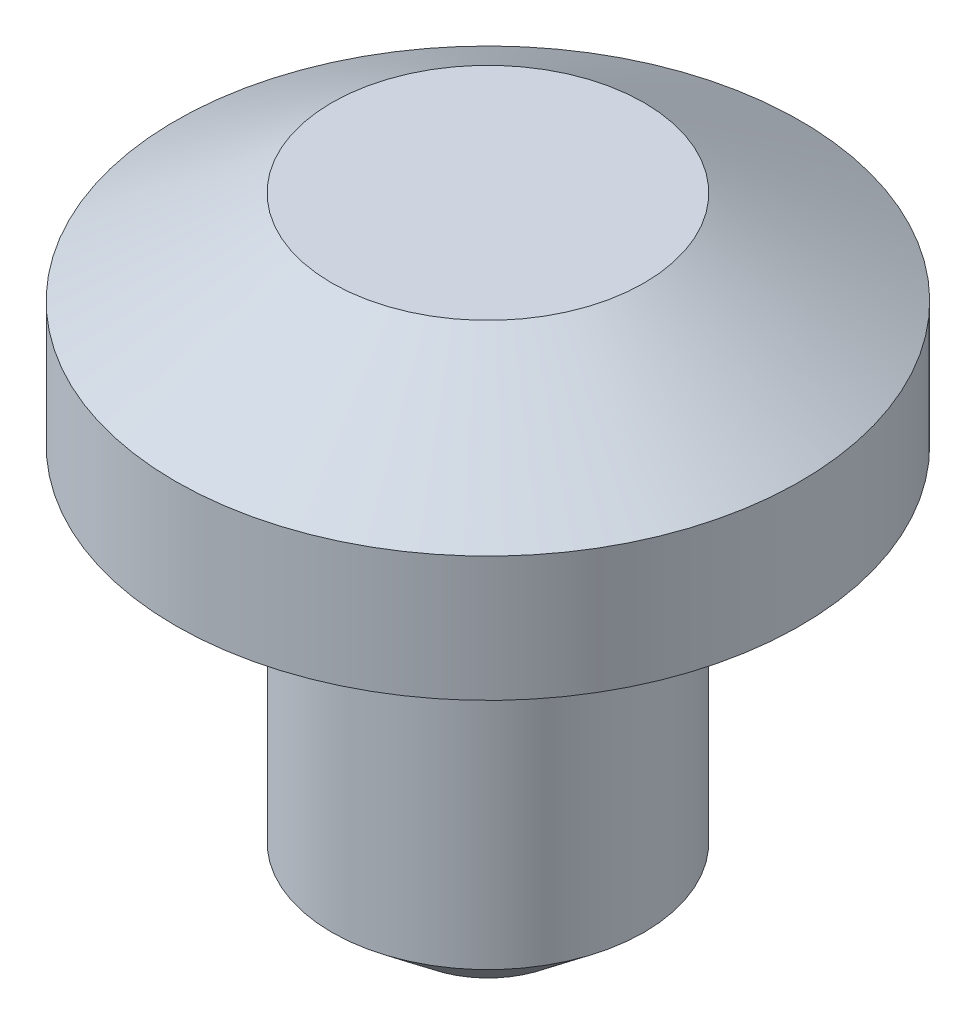
ISO-10303-21;
HEADER;
FILE_DESCRIPTION(('STEP AP214'),'2;1');
FILE_NAME('part.step','',(''),(''),'','','');
FILE_SCHEMA(('AUTOMOTIVE_DESIGN { 1 0 10303 214 1 1 1 1 }'));
ENDSEC;
DATA;
#1=APPLICATION_CONTEXT('core data for automotive mechanical design processes');
#2=APPLICATION_PROTOCOL_DEFINITION('international standard','automotive_design',2000,#1);
#3=PRODUCT_CONTEXT('',#1,'mechanical');
#4=PRODUCT('Part','Part','',(#3));
#5=PRODUCT_RELATED_PRODUCT_CATEGORY('part','',(#4));
#6=PRODUCT_DEFINITION_FORMATION('','',#4);
#7=PRODUCT_DEFINITION_CONTEXT('part definition',#1,'design');
#8=PRODUCT_DEFINITION('design','',#6,#7);
#9=PRODUCT_DEFINITION_SHAPE('','',#8);
#10=(LENGTH_UNIT() NAMED_UNIT(*) SI_UNIT(.MILLI.,.METRE.));
#11=(NAMED_UNIT(*) PLANE_ANGLE_UNIT() SI_UNIT($,.RADIAN.));
#12=(NAMED_UNIT(*) SI_UNIT($,.STERADIAN.) SOLID_ANGLE_UNIT());
#13=UNCERTAINTY_MEASURE_WITH_UNIT(LENGTH_MEASURE(1.E-05),#10,'distance_accuracy_value','');
#14=(GEOMETRIC_REPRESENTATION_CONTEXT(3) GLOBAL_UNCERTAINTY_ASSIGNED_CONTEXT((#13)) GLOBAL_UNIT_ASSIGNED_CONTEXT((#10,
#11,#12)) REPRESENTATION_CONTEXT('',''));
#15=CARTESIAN_POINT('',(0.,0.,0.));
#16=DIRECTION('',(0.,0.,1.));
#17=DIRECTION('',(1.,0.,0.));
#18=AXIS2_PLACEMENT_3D('',#15,#16,#17);
#19=CARTESIAN_POINT('',(0.,63.5,0.));
#20=DIRECTION('',(0.,1.,0.));
#21=DIRECTION('',(-1.,0.,0.));
#22=AXIS2_PLACEMENT_3D('',#19,#20,#21);
#23=CYLINDRICAL_SURFACE('',#22,31.75);
#24=CARTESIAN_POINT('',(0.,0.,0.));
#25=DIRECTION('',(0.,1.,0.));
#26=DIRECTION('',(0.,0.,1.));
#27=AXIS2_PLACEMENT_3D('',#24,#25,#26);
#28=CIRCLE('',#27,31.75);
#29=CARTESIAN_POINT('',(0.,0.,31.75));
#30=VERTEX_POINT('',#29);
#31=EDGE_CURVE('E46',#30,#30,#28,.T.);
#32=ORIENTED_EDGE('',*,*,#31,.F.);
#33=EDGE_LOOP('',(#32));
#34=FACE_BOUND('',#33,.T.);
#35=CARTESIAN_POINT('',(0.,-50.8,0.));
#36=DIRECTION('',(0.,1.,0.));
#37=DIRECTION('',(0.,0.,1.));
#38=AXIS2_PLACEMENT_3D('',#35,#36,#37);
#39=CIRCLE('',#38,31.75);
#40=CARTESIAN_POINT('',(0.,-50.8,31.75));
#41=VERTEX_POINT('',#40);
#42=EDGE_CURVE('E51',#41,#41,#39,.T.);
#43=ORIENTED_EDGE('',*,*,#42,.T.);
#44=EDGE_LOOP('',(#43));
#45=FACE_BOUND('',#44,.T.);
#46=ADVANCED_FACE('F31',(#34,#45),#23,.T.);
#47=CARTESIAN_POINT('',(0.,63.5,0.));
#48=DIRECTION('',(0.,1.,0.));
#49=DIRECTION('',(-1.,0.,0.));
#50=AXIS2_PLACEMENT_3D('',#47,#48,#49);
#51=CYLINDRICAL_SURFACE('',#50,63.5);
#52=CARTESIAN_POINT('',(0.,44.45,0.));
#53=DIRECTION('',(0.,1.,0.));
#54=DIRECTION('',(0.,0.,1.));
#55=AXIS2_PLACEMENT_3D('',#52,#53,#54);
#56=CIRCLE('',#55,63.5);
#57=CARTESIAN_POINT('',(0.,44.45,63.5));
#58=VERTEX_POINT('',#57);
#59=EDGE_CURVE('E38',#58,#58,#56,.T.);
#60=ORIENTED_EDGE('',*,*,#59,.F.);
#61=EDGE_LOOP('',(#60));
#62=FACE_BOUND('',#61,.T.);
#63=CARTESIAN_POINT('',(0.,19.05,0.));
#64=DIRECTION('',(0.,1.,0.));
#65=DIRECTION('',(0.,0.,1.));
#66=AXIS2_PLACEMENT_3D('',#63,#64,#65);
#67=CIRCLE('',#66,63.5);
#68=CARTESIAN_POINT('',(0.,19.05,63.5));
#69=VERTEX_POINT('',#68);
#70=EDGE_CURVE('E42',#69,#69,#67,.T.);
#71=ORIENTED_EDGE('',*,*,#70,.T.);
#72=EDGE_LOOP('',(#71));
#73=FACE_BOUND('',#72,.T.);
#74=ADVANCED_FACE('F33',(#62,#73),#51,.T.);
#75=CARTESIAN_POINT('',(0.,63.5,0.));
#76=DIRECTION('',(0.,-1.,0.));
#77=DIRECTION('',(0.,0.,-1.));
#78=AXIS2_PLACEMENT_3D('',#75,#76,#77);
#79=CONICAL_SURFACE('',#78,31.75,1.03037682652431);
#80=ORIENTED_EDGE('',*,*,#59,.T.);
#81=EDGE_LOOP('',(#80));
#82=FACE_BOUND('',#81,.T.);
#83=CARTESIAN_POINT('',(0.,63.5,0.));
#84=DIRECTION('',(0.,1.,0.));
#85=DIRECTION('',(0.,0.,1.));
#86=AXIS2_PLACEMENT_3D('',#83,#84,#85);
#87=CIRCLE('',#86,31.75);
#88=CARTESIAN_POINT('',(0.,63.5,31.75));
#89=VERTEX_POINT('',#88);
#90=EDGE_CURVE('E10',#89,#89,#87,.T.);
#91=ORIENTED_EDGE('',*,*,#90,.F.);
#92=EDGE_LOOP('',(#91));
#93=FACE_BOUND('',#92,.T.);
#94=ADVANCED_FACE('F76',(#82,#93),#79,.T.);
#95=CARTESIAN_POINT('',(-63.5,63.5,0.));
#96=DIRECTION('',(0.,1.,0.));
#97=DIRECTION('',(-1.,0.,0.));
#98=AXIS2_PLACEMENT_3D('',#95,#96,#97);
#99=PLANE('',#98);
#100=ORIENTED_EDGE('',*,*,#90,.T.);
#101=EDGE_LOOP('',(#100));
#102=FACE_BOUND('',#101,.T.);
#103=ADVANCED_FACE('F83',(#102),#99,.T.);
#104=CARTESIAN_POINT('',(0.,19.05,0.));
#105=DIRECTION('',(0.,1.,0.));
#106=DIRECTION('',(0.,0.,1.));
#107=AXIS2_PLACEMENT_3D('',#104,#105,#106);
#108=CONICAL_SURFACE('',#107,63.5,1.03037682652431);
#109=ORIENTED_EDGE('',*,*,#31,.T.);
#110=EDGE_LOOP('',(#109));
#111=FACE_BOUND('',#110,.T.);
#112=ORIENTED_EDGE('',*,*,#70,.F.);
#113=EDGE_LOOP('',(#112));
#114=FACE_BOUND('',#113,.T.);
#115=ADVANCED_FACE('F68',(#111,#114),#108,.T.);
#116=CARTESIAN_POINT('',(0.,-50.8,0.));
#117=DIRECTION('',(0.,1.,0.));
#118=DIRECTION('',(0.,0.,1.));
#119=AXIS2_PLACEMENT_3D('',#116,#117,#118);
#120=CONICAL_SURFACE('',#119,31.75,0.896055384571346);
#121=CARTESIAN_POINT('',(0.,-63.5,0.));
#122=DIRECTION('',(0.,1.,0.));
#123=DIRECTION('',(0.,0.,1.));
#124=AXIS2_PLACEMENT_3D('',#121,#122,#123);
#125=CIRCLE('',#124,15.875);
#126=CARTESIAN_POINT('',(0.,-63.5,15.875));
#127=VERTEX_POINT('',#126);
#128=EDGE_CURVE('E54',#127,#127,#125,.T.);
#129=ORIENTED_EDGE('',*,*,#128,.T.);
#130=EDGE_LOOP('',(#129));
#131=FACE_BOUND('',#130,.T.);
#132=ORIENTED_EDGE('',*,*,#42,.F.);
#133=EDGE_LOOP('',(#132));
#134=FACE_BOUND('',#133,.T.);
#135=ADVANCED_FACE('F58',(#131,#134),#120,.T.);
#136=CARTESIAN_POINT('',(-31.75,-63.5,0.));
#137=DIRECTION('',(0.,-1.,0.));
#138=DIRECTION('',(1.,0.,0.));
#139=AXIS2_PLACEMENT_3D('',#136,#137,#138);
#140=PLANE('',#139);
#141=ORIENTED_EDGE('',*,*,#128,.F.);
#142=EDGE_LOOP('',(#141));
#143=FACE_BOUND('',#142,.T.);
#144=ADVANCED_FACE('F61',(#143),#140,.T.);
#145=CLOSED_SHELL('',(#46,#74,#94,#103,#115,#135,#144));
#146=MANIFOLD_SOLID_BREP('B2',#145);
#147=ADVANCED_BREP_SHAPE_REPRESENTATION('',(#18,#146),#14);
#148=SHAPE_DEFINITION_REPRESENTATION(#9,#147);
ENDSEC;
END-ISO-10303-21;
